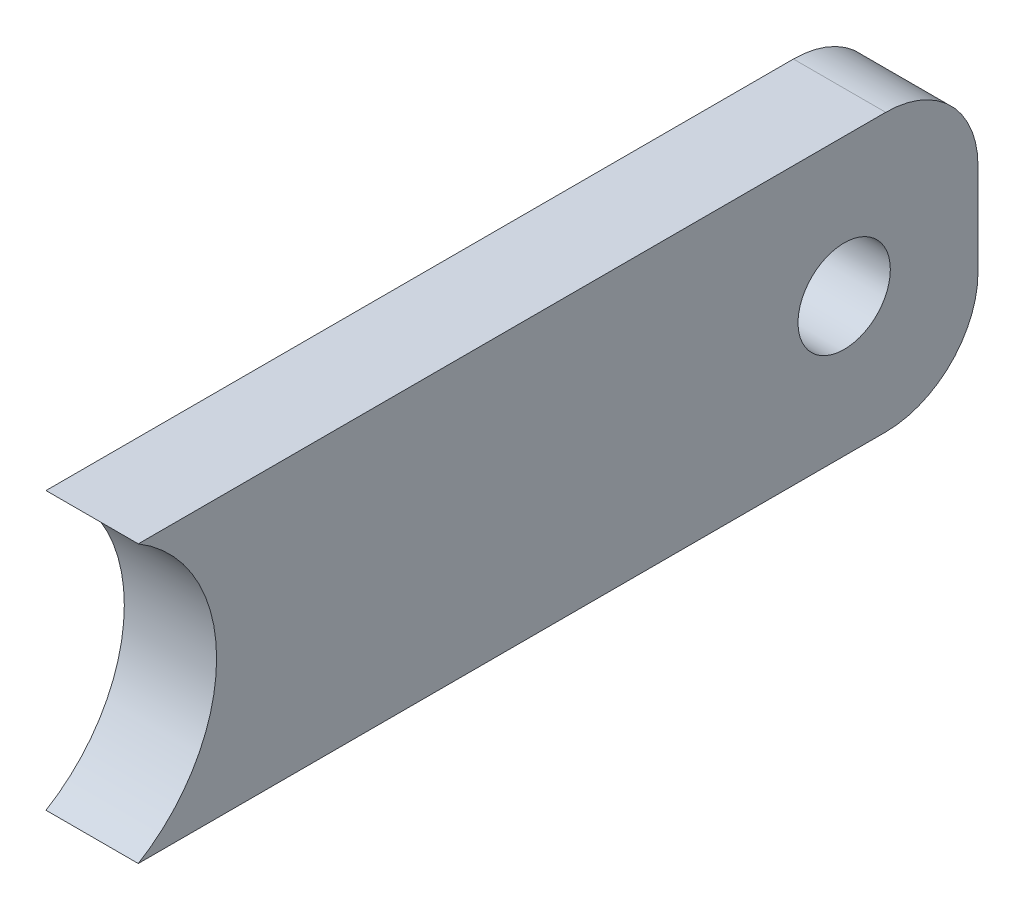
ISO-10303-21;
HEADER;
FILE_DESCRIPTION(('STEP AP214'),'2;1');
FILE_NAME('part.step','',(''),(''),'','','');
FILE_SCHEMA(('AUTOMOTIVE_DESIGN { 1 0 10303 214 1 1 1 1 }'));
ENDSEC;
DATA;
#1=APPLICATION_CONTEXT('core data for automotive mechanical design processes');
#2=APPLICATION_PROTOCOL_DEFINITION('international standard','automotive_design',2000,#1);
#3=PRODUCT_CONTEXT('',#1,'mechanical');
#4=PRODUCT('Part','Part','',(#3));
#5=PRODUCT_RELATED_PRODUCT_CATEGORY('part','',(#4));
#6=PRODUCT_DEFINITION_FORMATION('','',#4);
#7=PRODUCT_DEFINITION_CONTEXT('part definition',#1,'design');
#8=PRODUCT_DEFINITION('design','',#6,#7);
#9=PRODUCT_DEFINITION_SHAPE('','',#8);
#10=(LENGTH_UNIT() NAMED_UNIT(*) SI_UNIT(.MILLI.,.METRE.));
#11=(NAMED_UNIT(*) PLANE_ANGLE_UNIT() SI_UNIT($,.RADIAN.));
#12=(NAMED_UNIT(*) SI_UNIT($,.STERADIAN.) SOLID_ANGLE_UNIT());
#13=UNCERTAINTY_MEASURE_WITH_UNIT(LENGTH_MEASURE(1.E-05),#10,'distance_accuracy_value','');
#14=(GEOMETRIC_REPRESENTATION_CONTEXT(3) GLOBAL_UNCERTAINTY_ASSIGNED_CONTEXT((#13)) GLOBAL_UNIT_ASSIGNED_CONTEXT((#10,
#11,#12)) REPRESENTATION_CONTEXT('',''));
#15=CARTESIAN_POINT('',(0.,0.,0.));
#16=DIRECTION('',(0.,0.,1.));
#17=DIRECTION('',(1.,0.,0.));
#18=AXIS2_PLACEMENT_3D('',#15,#16,#17);
#19=CARTESIAN_POINT('',(0.,3.88578058618805E-13,-100.000000000001));
#20=DIRECTION('',(0.,0.,1.));
#21=DIRECTION('',(1.,0.,0.));
#22=AXIS2_PLACEMENT_3D('',#19,#20,#21);
#23=PLANE('',#22);
#24=DIRECTION('',(0.,-1.,0.));
#25=VECTOR('',#24,1.);
#26=CARTESIAN_POINT('',(-590.,-14.9999999999998,-100.));
#27=LINE('',#26,#25);
#28=CARTESIAN_POINT('',(-589.999999999999,5.00000000000006,-100.));
#29=VERTEX_POINT('',#28);
#30=CARTESIAN_POINT('',(-590.,-4.99999999999984,-100.));
#31=VERTEX_POINT('',#30);
#32=EDGE_CURVE('E125',#29,#31,#27,.T.);
#33=ORIENTED_EDGE('',*,*,#32,.T.);
#34=DIRECTION('',(-1.,0.,0.));
#35=VECTOR('',#34,1.);
#36=CARTESIAN_POINT('',(0.,-5.00000000000012,-100.000000000001));
#37=LINE('',#36,#35);
#38=CARTESIAN_POINT('',(-600.,-4.9999999999998,-100.000000000001));
#39=VERTEX_POINT('',#38);
#40=EDGE_CURVE('E145',#31,#39,#37,.T.);
#41=ORIENTED_EDGE('',*,*,#40,.T.);
#42=DIRECTION('',(0.,1.,0.));
#43=VECTOR('',#42,1.);
#44=CARTESIAN_POINT('',(-600.,-14.9999999999999,-100.000000000001));
#45=LINE('',#44,#43);
#46=CARTESIAN_POINT('',(-599.999999999999,5.0000000000001,-100.));
#47=VERTEX_POINT('',#46);
#48=EDGE_CURVE('E129',#39,#47,#45,.T.);
#49=ORIENTED_EDGE('',*,*,#48,.T.);
#50=DIRECTION('',(1.,0.,0.));
#51=VECTOR('',#50,1.);
#52=CARTESIAN_POINT('',(0.,5.00000000000023,-100.));
#53=LINE('',#52,#51);
#54=EDGE_CURVE('E141',#47,#29,#53,.T.);
#55=ORIENTED_EDGE('',*,*,#54,.T.);
#56=EDGE_LOOP('',(#33,#41,#49,#55));
#57=FACE_BOUND('',#56,.T.);
#58=ADVANCED_FACE('F40',(#57),#23,.F.);
#59=CARTESIAN_POINT('',(617.5,1.2490009027033E-13,2.22044604925031E-13));
#60=DIRECTION('',(-1.,0.,0.));
#61=DIRECTION('',(0.,0.,1.));
#62=AXIS2_PLACEMENT_3D('',#59,#60,#61);
#63=CYLINDRICAL_SURFACE('',#62,17.5);
#64=DIRECTION('',(-1.,0.,0.));
#65=VECTOR('',#64,1.);
#66=CARTESIAN_POINT('',(617.5,-14.9999999999999,-9.01387818865995));
#67=LINE('',#66,#65);
#68=CARTESIAN_POINT('',(-600.,-15.0000000000001,-9.01387818865995));
#69=VERTEX_POINT('',#68);
#70=CARTESIAN_POINT('',(-590.,-15.0000000000001,-9.01387818865995));
#71=VERTEX_POINT('',#70);
#72=EDGE_CURVE('E111',#69,#71,#67,.F.);
#73=ORIENTED_EDGE('',*,*,#72,.T.);
#74=CARTESIAN_POINT('',(-590.,0.,-3.33066907387547E-13));
#75=DIRECTION('',(-1.,0.,0.));
#76=DIRECTION('',(0.,0.,1.));
#77=AXIS2_PLACEMENT_3D('',#74,#75,#76);
#78=CIRCLE('',#77,17.5);
#79=CARTESIAN_POINT('',(-589.999999999999,15.0000000000002,-9.01387818865995));
#80=VERTEX_POINT('',#79);
#81=EDGE_CURVE('E95',#71,#80,#78,.F.);
#82=ORIENTED_EDGE('',*,*,#81,.T.);
#83=DIRECTION('',(-1.,0.,0.));
#84=VECTOR('',#83,1.);
#85=CARTESIAN_POINT('',(617.5,15.0000000000001,-9.01387818865995));
#86=LINE('',#85,#84);
#87=CARTESIAN_POINT('',(-600.,15.0000000000002,-9.01387818866006));
#88=VERTEX_POINT('',#87);
#89=EDGE_CURVE('E108',#80,#88,#86,.T.);
#90=ORIENTED_EDGE('',*,*,#89,.T.);
#91=CARTESIAN_POINT('',(-600.,1.45716771982052E-13,-3.33066907387547E-13));
#92=DIRECTION('',(1.,0.,0.));
#93=DIRECTION('',(0.,0.,-1.));
#94=AXIS2_PLACEMENT_3D('',#91,#92,#93);
#95=CIRCLE('',#94,17.5);
#96=EDGE_CURVE('E117',#88,#69,#95,.F.);
#97=ORIENTED_EDGE('',*,*,#96,.T.);
#98=EDGE_LOOP('',(#73,#82,#90,#97));
#99=FACE_BOUND('',#98,.T.);
#100=ADVANCED_FACE('F106',(#99),#63,.F.);
#101=CARTESIAN_POINT('',(-600.,-14.9999999999999,-100.000000000001));
#102=DIRECTION('',(1.,0.,0.));
#103=DIRECTION('',(0.,0.,-1.));
#104=AXIS2_PLACEMENT_3D('',#101,#102,#103);
#105=PLANE('',#104);
#106=CARTESIAN_POINT('',(-599.999999999999,2.0122792321331E-13,-85.5000000000002));
#107=DIRECTION('',(1.,0.,0.));
#108=DIRECTION('',(0.,0.,-1.));
#109=AXIS2_PLACEMENT_3D('',#106,#107,#108);
#110=CIRCLE('',#109,4.99999999999988);
#111=CARTESIAN_POINT('',(-599.999999999999,2.01505478969466E-13,-90.5000000000001));
#112=VERTEX_POINT('',#111);
#113=EDGE_CURVE('E133',#112,#112,#110,.T.);
#114=ORIENTED_EDGE('',*,*,#113,.T.);
#115=EDGE_LOOP('',(#114));
#116=FACE_BOUND('',#115,.T.);
#117=ORIENTED_EDGE('',*,*,#48,.F.);
#118=CARTESIAN_POINT('',(-600.,-4.9999999999998,-90.0000000000005));
#119=DIRECTION('',(1.,0.,0.));
#120=DIRECTION('',(0.,0.,-1.));
#121=AXIS2_PLACEMENT_3D('',#118,#119,#120);
#122=CIRCLE('',#121,10.);
#123=CARTESIAN_POINT('',(-600.,-14.9999999999996,-90.0000000000003));
#124=VERTEX_POINT('',#123);
#125=EDGE_CURVE('E152',#39,#124,#122,.F.);
#126=ORIENTED_EDGE('',*,*,#125,.T.);
#127=DIRECTION('',(0.,0.,1.));
#128=VECTOR('',#127,1.);
#129=CARTESIAN_POINT('',(-600.,-14.9999999999999,-100.000000000001));
#130=LINE('',#129,#128);
#131=EDGE_CURVE('E101',#124,#69,#130,.T.);
#132=ORIENTED_EDGE('',*,*,#131,.T.);
#133=ORIENTED_EDGE('',*,*,#96,.F.);
#134=DIRECTION('',(0.,0.,1.));
#135=VECTOR('',#134,1.);
#136=CARTESIAN_POINT('',(-599.999999999999,15.0000000000002,-100.000000000001));
#137=LINE('',#136,#135);
#138=CARTESIAN_POINT('',(-599.999999999999,15.0000000000003,-90.0000000000004));
#139=VERTEX_POINT('',#138);
#140=EDGE_CURVE('E100',#139,#88,#137,.T.);
#141=ORIENTED_EDGE('',*,*,#140,.F.);
#142=CARTESIAN_POINT('',(-599.999999999999,5.00000000000004,-90.0000000000007));
#143=DIRECTION('',(1.,0.,0.));
#144=DIRECTION('',(0.,0.,-1.));
#145=AXIS2_PLACEMENT_3D('',#142,#143,#144);
#146=CIRCLE('',#145,10.);
#147=EDGE_CURVE('E149',#139,#47,#146,.F.);
#148=ORIENTED_EDGE('',*,*,#147,.T.);
#149=EDGE_LOOP('',(#117,#126,#132,#133,#141,#148));
#150=FACE_BOUND('',#149,.T.);
#151=ADVANCED_FACE('F169',(#116,#150),#105,.F.);
#152=CARTESIAN_POINT('',(-590.,-14.9999999999998,-100.));
#153=DIRECTION('',(-1.,0.,0.));
#154=DIRECTION('',(0.,0.,1.));
#155=AXIS2_PLACEMENT_3D('',#152,#153,#154);
#156=PLANE('',#155);
#157=CARTESIAN_POINT('',(-589.999999999999,1.6306400674182E-13,-85.5000000000002));
#158=DIRECTION('',(1.,0.,0.));
#159=DIRECTION('',(0.,0.,-1.));
#160=AXIS2_PLACEMENT_3D('',#157,#158,#159);
#161=CIRCLE('',#160,4.99999999999991);
#162=CARTESIAN_POINT('',(-589.999999999999,1.63341562497976E-13,-90.5000000000002));
#163=VERTEX_POINT('',#162);
#164=EDGE_CURVE('E194',#163,#163,#161,.T.);
#165=ORIENTED_EDGE('',*,*,#164,.F.);
#166=EDGE_LOOP('',(#165));
#167=FACE_BOUND('',#166,.T.);
#168=DIRECTION('',(0.,0.,1.));
#169=VECTOR('',#168,1.);
#170=CARTESIAN_POINT('',(-590.,-14.9999999999998,-100.));
#171=LINE('',#170,#169);
#172=CARTESIAN_POINT('',(-590.,-14.9999999999997,-90.0000000000003));
#173=VERTEX_POINT('',#172);
#174=EDGE_CURVE('E138',#173,#71,#171,.T.);
#175=ORIENTED_EDGE('',*,*,#174,.F.);
#176=CARTESIAN_POINT('',(-590.,-4.99999999999978,-90.0000000000005));
#177=DIRECTION('',(-1.,0.,0.));
#178=DIRECTION('',(0.,0.,1.));
#179=AXIS2_PLACEMENT_3D('',#176,#177,#178);
#180=CIRCLE('',#179,10.);
#181=EDGE_CURVE('E49',#173,#31,#180,.F.);
#182=ORIENTED_EDGE('',*,*,#181,.T.);
#183=ORIENTED_EDGE('',*,*,#32,.F.);
#184=CARTESIAN_POINT('',(-589.999999999999,5.00000000000022,-90.0000000000004));
#185=DIRECTION('',(-1.,0.,0.));
#186=DIRECTION('',(0.,0.,1.));
#187=AXIS2_PLACEMENT_3D('',#184,#185,#186);
#188=CIRCLE('',#187,10.);
#189=CARTESIAN_POINT('',(-589.999999999999,15.0000000000003,-90.0000000000004));
#190=VERTEX_POINT('',#189);
#191=EDGE_CURVE('E56',#29,#190,#188,.F.);
#192=ORIENTED_EDGE('',*,*,#191,.T.);
#193=DIRECTION('',(0.,0.,1.));
#194=VECTOR('',#193,1.);
#195=CARTESIAN_POINT('',(-589.999999999999,15.0000000000003,-100.));
#196=LINE('',#195,#194);
#197=EDGE_CURVE('E92',#190,#80,#196,.T.);
#198=ORIENTED_EDGE('',*,*,#197,.T.);
#199=ORIENTED_EDGE('',*,*,#81,.F.);
#200=EDGE_LOOP('',(#175,#182,#183,#192,#198,#199));
#201=FACE_BOUND('',#200,.T.);
#202=ADVANCED_FACE('F94',(#167,#201),#156,.F.);
#203=CARTESIAN_POINT('',(-589.999999999999,15.0000000000003,-100.));
#204=DIRECTION('',(0.,-1.,0.));
#205=DIRECTION('',(0.,0.,-1.));
#206=AXIS2_PLACEMENT_3D('',#203,#204,#205);
#207=PLANE('',#206);
#208=ORIENTED_EDGE('',*,*,#197,.F.);
#209=DIRECTION('',(1.,0.,0.));
#210=VECTOR('',#209,1.);
#211=CARTESIAN_POINT('',(-589.999999999999,15.0000000000003,-90.0000000000004));
#212=LINE('',#211,#210);
#213=EDGE_CURVE('E11',#190,#139,#212,.F.);
#214=ORIENTED_EDGE('',*,*,#213,.T.);
#215=ORIENTED_EDGE('',*,*,#140,.T.);
#216=ORIENTED_EDGE('',*,*,#89,.F.);
#217=EDGE_LOOP('',(#208,#214,#215,#216));
#218=FACE_BOUND('',#217,.T.);
#219=ADVANCED_FACE('F114',(#218),#207,.F.);
#220=CARTESIAN_POINT('',(-600.,-14.9999999999999,-100.000000000001));
#221=DIRECTION('',(0.,1.,0.));
#222=DIRECTION('',(0.,0.,1.));
#223=AXIS2_PLACEMENT_3D('',#220,#221,#222);
#224=PLANE('',#223);
#225=ORIENTED_EDGE('',*,*,#131,.F.);
#226=DIRECTION('',(-1.,0.,0.));
#227=VECTOR('',#226,1.);
#228=CARTESIAN_POINT('',(-600.,-14.9999999999996,-90.0000000000003));
#229=LINE('',#228,#227);
#230=EDGE_CURVE('E64',#124,#173,#229,.F.);
#231=ORIENTED_EDGE('',*,*,#230,.T.);
#232=ORIENTED_EDGE('',*,*,#174,.T.);
#233=ORIENTED_EDGE('',*,*,#72,.F.);
#234=EDGE_LOOP('',(#225,#231,#232,#233));
#235=FACE_BOUND('',#234,.T.);
#236=ADVANCED_FACE('F170',(#235),#224,.F.);
#237=CARTESIAN_POINT('',(0.,-4.99999999999984,-90.0000000000003));
#238=DIRECTION('',(-1.,0.,0.));
#239=DIRECTION('',(0.,0.,1.));
#240=AXIS2_PLACEMENT_3D('',#237,#238,#239);
#241=CYLINDRICAL_SURFACE('',#240,10.);
#242=ORIENTED_EDGE('',*,*,#181,.F.);
#243=ORIENTED_EDGE('',*,*,#230,.F.);
#244=ORIENTED_EDGE('',*,*,#125,.F.);
#245=ORIENTED_EDGE('',*,*,#40,.F.);
#246=EDGE_LOOP('',(#242,#243,#244,#245));
#247=FACE_BOUND('',#246,.T.);
#248=ADVANCED_FACE('F167',(#247),#241,.T.);
#249=CARTESIAN_POINT('',(0.,4.99999999999995,-90.0000000000001));
#250=DIRECTION('',(1.,0.,0.));
#251=DIRECTION('',(0.,0.,-1.));
#252=AXIS2_PLACEMENT_3D('',#249,#250,#251);
#253=CYLINDRICAL_SURFACE('',#252,10.);
#254=ORIENTED_EDGE('',*,*,#147,.F.);
#255=ORIENTED_EDGE('',*,*,#213,.F.);
#256=ORIENTED_EDGE('',*,*,#191,.F.);
#257=ORIENTED_EDGE('',*,*,#54,.F.);
#258=EDGE_LOOP('',(#254,#255,#256,#257));
#259=FACE_BOUND('',#258,.T.);
#260=ADVANCED_FACE('F42',(#259),#253,.T.);
#261=CARTESIAN_POINT('',(-589.999999999999,1.6306400674182E-13,-85.5000000000002));
#262=DIRECTION('',(1.,0.,0.));
#263=DIRECTION('',(0.,0.,-1.));
#264=AXIS2_PLACEMENT_3D('',#261,#262,#263);
#265=CYLINDRICAL_SURFACE('',#264,4.99999999999988);
#266=ORIENTED_EDGE('',*,*,#164,.T.);
#267=EDGE_LOOP('',(#266));
#268=FACE_BOUND('',#267,.T.);
#269=ORIENTED_EDGE('',*,*,#113,.F.);
#270=EDGE_LOOP('',(#269));
#271=FACE_BOUND('',#270,.T.);
#272=ADVANCED_FACE('F204',(#268,#271),#265,.F.);
#273=CLOSED_SHELL('',(#58,#100,#151,#202,#219,#236,#248,#260,#272));
#274=MANIFOLD_SOLID_BREP('B2',#273);
#275=ADVANCED_BREP_SHAPE_REPRESENTATION('',(#18,#274),#14);
#276=SHAPE_DEFINITION_REPRESENTATION(#9,#275);
ENDSEC;
END-ISO-10303-21;
